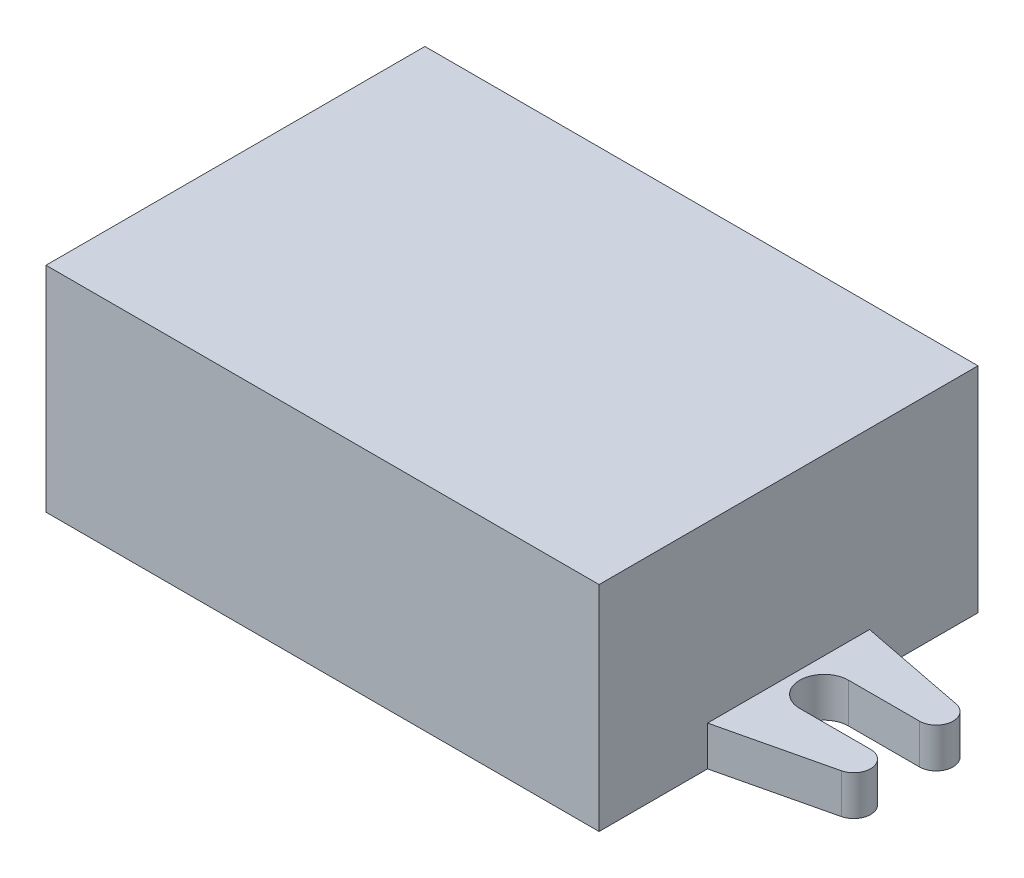
ISO-10303-21;
HEADER;
FILE_DESCRIPTION(('STEP AP214'),'2;1');
FILE_NAME('part.step','',(''),(''),'','','');
FILE_SCHEMA(('AUTOMOTIVE_DESIGN { 1 0 10303 214 1 1 1 1 }'));
ENDSEC;
DATA;
#1=APPLICATION_CONTEXT('core data for automotive mechanical design processes');
#2=APPLICATION_PROTOCOL_DEFINITION('international standard','automotive_design',2000,#1);
#3=PRODUCT_CONTEXT('',#1,'mechanical');
#4=PRODUCT('Part','Part','',(#3));
#5=PRODUCT_RELATED_PRODUCT_CATEGORY('part','',(#4));
#6=PRODUCT_DEFINITION_FORMATION('','',#4);
#7=PRODUCT_DEFINITION_CONTEXT('part definition',#1,'design');
#8=PRODUCT_DEFINITION('design','',#6,#7);
#9=PRODUCT_DEFINITION_SHAPE('','',#8);
#10=(LENGTH_UNIT() NAMED_UNIT(*) SI_UNIT(.MILLI.,.METRE.));
#11=(NAMED_UNIT(*) PLANE_ANGLE_UNIT() SI_UNIT($,.RADIAN.));
#12=(NAMED_UNIT(*) SI_UNIT($,.STERADIAN.) SOLID_ANGLE_UNIT());
#13=UNCERTAINTY_MEASURE_WITH_UNIT(LENGTH_MEASURE(1.E-05),#10,'distance_accuracy_value','');
#14=(GEOMETRIC_REPRESENTATION_CONTEXT(3) GLOBAL_UNCERTAINTY_ASSIGNED_CONTEXT((#13)) GLOBAL_UNIT_ASSIGNED_CONTEXT((#10,
#11,#12)) REPRESENTATION_CONTEXT('',''));
#15=CARTESIAN_POINT('',(0.,0.,0.));
#16=DIRECTION('',(0.,0.,1.));
#17=DIRECTION('',(1.,0.,0.));
#18=AXIS2_PLACEMENT_3D('',#15,#16,#17);
#19=CARTESIAN_POINT('',(-21.771462604241,17.78,-15.5655264340985));
#20=DIRECTION('',(1.,0.,0.));
#21=DIRECTION('',(0.,0.,-1.));
#22=AXIS2_PLACEMENT_3D('',#19,#20,#21);
#23=PLANE('',#22);
#24=DIRECTION('',(0.,-1.,0.));
#25=VECTOR('',#24,1.);
#26=CARTESIAN_POINT('',(-21.771462604241,3.302,-6.54852643409852));
#27=LINE('',#26,#25);
#28=CARTESIAN_POINT('',(-21.771462604241,3.302,-6.54852643409852));
#29=VERTEX_POINT('',#28);
#30=CARTESIAN_POINT('',(-21.771462604241,0.,-6.54852643409852));
#31=VERTEX_POINT('',#30);
#32=EDGE_CURVE('E263',#29,#31,#27,.T.);
#33=ORIENTED_EDGE('',*,*,#32,.F.);
#34=DIRECTION('',(0.,0.,-1.));
#35=VECTOR('',#34,1.);
#36=CARTESIAN_POINT('',(-21.771462604241,3.302,6.91347356590148));
#37=LINE('',#36,#35);
#38=CARTESIAN_POINT('',(-21.771462604241,3.302,6.91347356590148));
#39=VERTEX_POINT('',#38);
#40=EDGE_CURVE('E291',#39,#29,#37,.T.);
#41=ORIENTED_EDGE('',*,*,#40,.F.);
#42=DIRECTION('',(0.,-1.,0.));
#43=VECTOR('',#42,1.);
#44=CARTESIAN_POINT('',(-21.771462604241,3.302,6.91347356590148));
#45=LINE('',#44,#43);
#46=CARTESIAN_POINT('',(-21.771462604241,0.,6.91347356590149));
#47=VERTEX_POINT('',#46);
#48=EDGE_CURVE('E260',#39,#47,#45,.T.);
#49=ORIENTED_EDGE('',*,*,#48,.T.);
#50=DIRECTION('',(0.,0.,1.));
#51=VECTOR('',#50,1.);
#52=CARTESIAN_POINT('',(-21.771462604241,0.,-15.5655264340985));
#53=LINE('',#52,#51);
#54=CARTESIAN_POINT('',(-21.771462604241,0.,15.9304735659015));
#55=VERTEX_POINT('',#54);
#56=EDGE_CURVE('E256',#47,#55,#53,.T.);
#57=ORIENTED_EDGE('',*,*,#56,.T.);
#58=DIRECTION('',(0.,-1.,0.));
#59=VECTOR('',#58,1.);
#60=CARTESIAN_POINT('',(-21.771462604241,17.78,15.9304735659015));
#61=LINE('',#60,#59);
#62=CARTESIAN_POINT('',(-21.771462604241,17.78,15.9304735659015));
#63=VERTEX_POINT('',#62);
#64=EDGE_CURVE('E11',#63,#55,#61,.T.);
#65=ORIENTED_EDGE('',*,*,#64,.F.);
#66=DIRECTION('',(0.,0.,1.));
#67=VECTOR('',#66,1.);
#68=CARTESIAN_POINT('',(-21.771462604241,17.78,-15.5655264340985));
#69=LINE('',#68,#67);
#70=CARTESIAN_POINT('',(-21.771462604241,17.78,-15.5655264340985));
#71=VERTEX_POINT('',#70);
#72=EDGE_CURVE('E227',#71,#63,#69,.T.);
#73=ORIENTED_EDGE('',*,*,#72,.F.);
#74=DIRECTION('',(0.,-1.,0.));
#75=VECTOR('',#74,1.);
#76=CARTESIAN_POINT('',(-21.771462604241,17.78,-15.5655264340985));
#77=LINE('',#76,#75);
#78=CARTESIAN_POINT('',(-21.771462604241,0.,-15.5655264340985));
#79=VERTEX_POINT('',#78);
#80=EDGE_CURVE('E228',#71,#79,#77,.T.);
#81=ORIENTED_EDGE('',*,*,#80,.T.);
#82=EDGE_CURVE('E220',#79,#31,#53,.T.);
#83=ORIENTED_EDGE('',*,*,#82,.T.);
#84=EDGE_LOOP('',(#33,#41,#49,#57,#65,#73,#81,#83));
#85=FACE_BOUND('',#84,.T.);
#86=ADVANCED_FACE('F45',(#85),#23,.F.);
#87=CARTESIAN_POINT('',(-21.771462604241,17.78,15.9304735659015));
#88=DIRECTION('',(0.,0.,-1.));
#89=DIRECTION('',(-1.,0.,0.));
#90=AXIS2_PLACEMENT_3D('',#87,#88,#89);
#91=PLANE('',#90);
#92=DIRECTION('',(1.,0.,0.));
#93=VECTOR('',#92,1.);
#94=CARTESIAN_POINT('',(-21.771462604241,0.,15.9304735659015));
#95=LINE('',#94,#93);
#96=CARTESIAN_POINT('',(24.202537395759,0.,15.9304735659015));
#97=VERTEX_POINT('',#96);
#98=EDGE_CURVE('E214',#55,#97,#95,.T.);
#99=ORIENTED_EDGE('',*,*,#98,.T.);
#100=DIRECTION('',(0.,-1.,0.));
#101=VECTOR('',#100,1.);
#102=CARTESIAN_POINT('',(24.202537395759,17.78,15.9304735659015));
#103=LINE('',#102,#101);
#104=CARTESIAN_POINT('',(24.202537395759,17.78,15.9304735659015));
#105=VERTEX_POINT('',#104);
#106=EDGE_CURVE('E53',#105,#97,#103,.T.);
#107=ORIENTED_EDGE('',*,*,#106,.F.);
#108=DIRECTION('',(1.,0.,0.));
#109=VECTOR('',#108,1.);
#110=CARTESIAN_POINT('',(-21.771462604241,17.78,15.9304735659015));
#111=LINE('',#110,#109);
#112=EDGE_CURVE('E241',#63,#105,#111,.T.);
#113=ORIENTED_EDGE('',*,*,#112,.F.);
#114=ORIENTED_EDGE('',*,*,#64,.T.);
#115=EDGE_LOOP('',(#99,#107,#113,#114));
#116=FACE_BOUND('',#115,.T.);
#117=ADVANCED_FACE('F369',(#116),#91,.F.);
#118=CARTESIAN_POINT('',(24.202537395759,17.78,-15.5655264340985));
#119=DIRECTION('',(1.,0.,0.));
#120=DIRECTION('',(0.,0.,-1.));
#121=AXIS2_PLACEMENT_3D('',#118,#119,#120);
#122=PLANE('',#121);
#123=DIRECTION('',(0.,-1.,0.));
#124=VECTOR('',#123,1.);
#125=CARTESIAN_POINT('',(24.202537395759,3.302,6.91347356590148));
#126=LINE('',#125,#124);
#127=CARTESIAN_POINT('',(24.202537395759,3.302,6.91347356590148));
#128=VERTEX_POINT('',#127);
#129=CARTESIAN_POINT('',(24.202537395759,0.,6.91347356590148));
#130=VERTEX_POINT('',#129);
#131=EDGE_CURVE('E182',#128,#130,#126,.T.);
#132=ORIENTED_EDGE('',*,*,#131,.F.);
#133=DIRECTION('',(0.,0.,-1.));
#134=VECTOR('',#133,1.);
#135=CARTESIAN_POINT('',(24.202537395759,3.302,6.91347356590148));
#136=LINE('',#135,#134);
#137=CARTESIAN_POINT('',(24.202537395759,3.302,-6.54852643409852));
#138=VERTEX_POINT('',#137);
#139=EDGE_CURVE('E194',#128,#138,#136,.T.);
#140=ORIENTED_EDGE('',*,*,#139,.T.);
#141=DIRECTION('',(0.,-1.,0.));
#142=VECTOR('',#141,1.);
#143=CARTESIAN_POINT('',(24.202537395759,3.302,-6.54852643409852));
#144=LINE('',#143,#142);
#145=CARTESIAN_POINT('',(24.202537395759,0.,-6.54852643409852));
#146=VERTEX_POINT('',#145);
#147=EDGE_CURVE('E195',#138,#146,#144,.T.);
#148=ORIENTED_EDGE('',*,*,#147,.T.);
#149=DIRECTION('',(0.,0.,1.));
#150=VECTOR('',#149,1.);
#151=CARTESIAN_POINT('',(24.202537395759,0.,-15.5655264340985));
#152=LINE('',#151,#150);
#153=CARTESIAN_POINT('',(24.202537395759,0.,-15.5655264340985));
#154=VERTEX_POINT('',#153);
#155=EDGE_CURVE('E213',#154,#146,#152,.T.);
#156=ORIENTED_EDGE('',*,*,#155,.F.);
#157=DIRECTION('',(0.,-1.,0.));
#158=VECTOR('',#157,1.);
#159=CARTESIAN_POINT('',(24.202537395759,17.78,-15.5655264340985));
#160=LINE('',#159,#158);
#161=CARTESIAN_POINT('',(24.202537395759,17.78,-15.5655264340985));
#162=VERTEX_POINT('',#161);
#163=EDGE_CURVE('E231',#162,#154,#160,.T.);
#164=ORIENTED_EDGE('',*,*,#163,.F.);
#165=DIRECTION('',(0.,0.,1.));
#166=VECTOR('',#165,1.);
#167=CARTESIAN_POINT('',(24.202537395759,17.78,-15.5655264340985));
#168=LINE('',#167,#166);
#169=EDGE_CURVE('E238',#162,#105,#168,.T.);
#170=ORIENTED_EDGE('',*,*,#169,.T.);
#171=ORIENTED_EDGE('',*,*,#106,.T.);
#172=EDGE_CURVE('E201',#130,#97,#152,.T.);
#173=ORIENTED_EDGE('',*,*,#172,.F.);
#174=EDGE_LOOP('',(#132,#140,#148,#156,#164,#170,#171,#173));
#175=FACE_BOUND('',#174,.T.);
#176=ADVANCED_FACE('F208',(#175),#122,.T.);
#177=CARTESIAN_POINT('',(-21.771462604241,17.78,-15.5655264340985));
#178=DIRECTION('',(0.,0.,-1.));
#179=DIRECTION('',(-1.,0.,0.));
#180=AXIS2_PLACEMENT_3D('',#177,#178,#179);
#181=PLANE('',#180);
#182=DIRECTION('',(1.,0.,0.));
#183=VECTOR('',#182,1.);
#184=CARTESIAN_POINT('',(-21.771462604241,0.,-15.5655264340985));
#185=LINE('',#184,#183);
#186=EDGE_CURVE('E219',#79,#154,#185,.T.);
#187=ORIENTED_EDGE('',*,*,#186,.F.);
#188=ORIENTED_EDGE('',*,*,#80,.F.);
#189=DIRECTION('',(1.,0.,0.));
#190=VECTOR('',#189,1.);
#191=CARTESIAN_POINT('',(-21.771462604241,17.78,-15.5655264340985));
#192=LINE('',#191,#190);
#193=EDGE_CURVE('E232',#71,#162,#192,.T.);
#194=ORIENTED_EDGE('',*,*,#193,.T.);
#195=ORIENTED_EDGE('',*,*,#163,.T.);
#196=EDGE_LOOP('',(#187,#188,#194,#195));
#197=FACE_BOUND('',#196,.T.);
#198=ADVANCED_FACE('F378',(#197),#181,.T.);
#199=CARTESIAN_POINT('',(0.,17.78,0.));
#200=DIRECTION('',(0.,1.,0.));
#201=DIRECTION('',(0.,0.,1.));
#202=AXIS2_PLACEMENT_3D('',#199,#200,#201);
#203=PLANE('',#202);
#204=ORIENTED_EDGE('',*,*,#72,.T.);
#205=ORIENTED_EDGE('',*,*,#112,.T.);
#206=ORIENTED_EDGE('',*,*,#169,.F.);
#207=ORIENTED_EDGE('',*,*,#193,.F.);
#208=EDGE_LOOP('',(#204,#205,#206,#207));
#209=FACE_BOUND('',#208,.T.);
#210=ADVANCED_FACE('F495',(#209),#203,.T.);
#211=CARTESIAN_POINT('',(0.,0.,0.));
#212=DIRECTION('',(0.,1.,0.));
#213=DIRECTION('',(0.,0.,1.));
#214=AXIS2_PLACEMENT_3D('',#211,#212,#213);
#215=PLANE('',#214);
#216=ORIENTED_EDGE('',*,*,#82,.F.);
#217=ORIENTED_EDGE('',*,*,#186,.T.);
#218=ORIENTED_EDGE('',*,*,#155,.T.);
#219=DIRECTION('',(0.98132204195666,0.,0.192372165268294));
#220=VECTOR('',#219,1.);
#221=CARTESIAN_POINT('',(24.202537395759,0.,-6.54852643409852));
#222=LINE('',#221,#220);
#223=CARTESIAN_POINT('',(33.2318712642548,0.,-4.77847294202625));
#224=VERTEX_POINT('',#223);
#225=EDGE_CURVE('E60',#146,#224,#222,.T.);
#226=ORIENTED_EDGE('',*,*,#225,.T.);
#227=CARTESIAN_POINT('',(32.8705794448912,0.,-3.42900000000001));
#228=DIRECTION('',(0.,1.,0.));
#229=DIRECTION('',(0.,0.,1.));
#230=AXIS2_PLACEMENT_3D('',#227,#228,#229);
#231=CIRCLE('',#230,1.397);
#232=CARTESIAN_POINT('',(32.8705794448912,0.,-2.03200000000001));
#233=VERTEX_POINT('',#232);
#234=EDGE_CURVE('E384',#233,#224,#231,.T.);
#235=ORIENTED_EDGE('',*,*,#234,.F.);
#236=DIRECTION('',(-1.,0.,0.));
#237=VECTOR('',#236,1.);
#238=CARTESIAN_POINT('',(32.8705794448912,0.,-2.03200000000001));
#239=LINE('',#238,#237);
#240=CARTESIAN_POINT('',(26.9776546509918,0.,-2.03200000000001));
#241=VERTEX_POINT('',#240);
#242=EDGE_CURVE('E390',#233,#241,#239,.T.);
#243=ORIENTED_EDGE('',*,*,#242,.T.);
#244=CARTESIAN_POINT('',(26.9776546509918,0.,0.));
#245=DIRECTION('',(0.,1.,0.));
#246=DIRECTION('',(0.,0.,1.));
#247=AXIS2_PLACEMENT_3D('',#244,#245,#246);
#248=CIRCLE('',#247,2.032);
#249=CARTESIAN_POINT('',(26.9776546509918,0.,2.03199999999999));
#250=VERTEX_POINT('',#249);
#251=EDGE_CURVE('E397',#241,#250,#248,.T.);
#252=ORIENTED_EDGE('',*,*,#251,.T.);
#253=DIRECTION('',(-1.,0.,0.));
#254=VECTOR('',#253,1.);
#255=CARTESIAN_POINT('',(32.8705794448912,0.,2.03199999999999));
#256=LINE('',#255,#254);
#257=CARTESIAN_POINT('',(32.8705794448912,0.,2.03199999999999));
#258=VERTEX_POINT('',#257);
#259=EDGE_CURVE('E401',#258,#250,#256,.T.);
#260=ORIENTED_EDGE('',*,*,#259,.F.);
#261=CARTESIAN_POINT('',(32.8705794448912,0.,3.42899999999999));
#262=DIRECTION('',(0.,1.,0.));
#263=DIRECTION('',(0.,0.,1.));
#264=AXIS2_PLACEMENT_3D('',#261,#262,#263);
#265=CIRCLE('',#264,1.397);
#266=CARTESIAN_POINT('',(33.191916601946,0.,4.78854088996836));
#267=VERTEX_POINT('',#266);
#268=EDGE_CURVE('E204',#267,#258,#265,.T.);
#269=ORIENTED_EDGE('',*,*,#268,.F.);
#270=DIRECTION('',(0.973180485038376,0.,-0.230042916736143));
#271=VECTOR('',#270,1.);
#272=CARTESIAN_POINT('',(24.202537395759,0.,6.91347356590148));
#273=LINE('',#272,#271);
#274=EDGE_CURVE('E186',#130,#267,#273,.T.);
#275=ORIENTED_EDGE('',*,*,#274,.F.);
#276=ORIENTED_EDGE('',*,*,#172,.T.);
#277=ORIENTED_EDGE('',*,*,#98,.F.);
#278=ORIENTED_EDGE('',*,*,#56,.F.);
#279=DIRECTION('',(-0.973180485038376,0.,-0.230042916736143));
#280=VECTOR('',#279,1.);
#281=CARTESIAN_POINT('',(-21.771462604241,0.,6.91347356590148));
#282=LINE('',#281,#280);
#283=CARTESIAN_POINT('',(-30.760841810428,0.,4.78854088996837));
#284=VERTEX_POINT('',#283);
#285=EDGE_CURVE('E68',#47,#284,#282,.T.);
#286=ORIENTED_EDGE('',*,*,#285,.T.);
#287=CARTESIAN_POINT('',(-30.4395046533733,0.,3.429));
#288=DIRECTION('',(0.,-1.,0.));
#289=DIRECTION('',(0.,0.,-1.));
#290=AXIS2_PLACEMENT_3D('',#287,#288,#289);
#291=CIRCLE('',#290,1.397);
#292=CARTESIAN_POINT('',(-30.4395046533733,0.,2.032));
#293=VERTEX_POINT('',#292);
#294=EDGE_CURVE('E306',#284,#293,#291,.T.);
#295=ORIENTED_EDGE('',*,*,#294,.T.);
#296=DIRECTION('',(1.,0.,0.));
#297=VECTOR('',#296,1.);
#298=CARTESIAN_POINT('',(-30.4395046533733,0.,2.032));
#299=LINE('',#298,#297);
#300=CARTESIAN_POINT('',(-24.5465798594738,0.,2.032));
#301=VERTEX_POINT('',#300);
#302=EDGE_CURVE('E310',#293,#301,#299,.T.);
#303=ORIENTED_EDGE('',*,*,#302,.T.);
#304=CARTESIAN_POINT('',(-24.5465798594738,0.,0.));
#305=DIRECTION('',(0.,-1.,0.));
#306=DIRECTION('',(0.,0.,-1.));
#307=AXIS2_PLACEMENT_3D('',#304,#305,#306);
#308=CIRCLE('',#307,2.032);
#309=CARTESIAN_POINT('',(-24.5465798594738,0.,-2.032));
#310=VERTEX_POINT('',#309);
#311=EDGE_CURVE('E314',#310,#301,#308,.T.);
#312=ORIENTED_EDGE('',*,*,#311,.F.);
#313=DIRECTION('',(1.,0.,0.));
#314=VECTOR('',#313,1.);
#315=CARTESIAN_POINT('',(-30.4395046533733,0.,-2.032));
#316=LINE('',#315,#314);
#317=CARTESIAN_POINT('',(-30.4395046533733,0.,-2.032));
#318=VERTEX_POINT('',#317);
#319=EDGE_CURVE('E318',#318,#310,#316,.T.);
#320=ORIENTED_EDGE('',*,*,#319,.F.);
#321=CARTESIAN_POINT('',(-30.4395046533733,0.,-3.429));
#322=DIRECTION('',(0.,-1.,0.));
#323=DIRECTION('',(0.,0.,-1.));
#324=AXIS2_PLACEMENT_3D('',#321,#322,#323);
#325=CIRCLE('',#324,1.397);
#326=CARTESIAN_POINT('',(-30.8007964727368,0.,-4.77847294202625));
#327=VERTEX_POINT('',#326);
#328=EDGE_CURVE('E320',#318,#327,#325,.T.);
#329=ORIENTED_EDGE('',*,*,#328,.T.);
#330=DIRECTION('',(-0.98132204195666,0.,0.192372165268294));
#331=VECTOR('',#330,1.);
#332=CARTESIAN_POINT('',(-21.771462604241,0.,-6.54852643409852));
#333=LINE('',#332,#331);
#334=EDGE_CURVE('E270',#31,#327,#333,.T.);
#335=ORIENTED_EDGE('',*,*,#334,.F.);
#336=EDGE_LOOP('',(#216,#217,#218,#226,#235,#243,#252,#260,#269,#275,#276,#277,#278,#286,#295,
#303,#312,#320,#329,#335));
#337=FACE_BOUND('',#336,.T.);
#338=ADVANCED_FACE('F199',(#337),#215,.F.);
#339=CARTESIAN_POINT('',(-21.771462604241,3.302,6.91347356590148));
#340=DIRECTION('',(-0.230042916736143,0.,0.973180485038376));
#341=DIRECTION('',(0.973180485038376,0.,0.230042916736143));
#342=AXIS2_PLACEMENT_3D('',#339,#340,#341);
#343=PLANE('',#342);
#344=ORIENTED_EDGE('',*,*,#285,.F.);
#345=ORIENTED_EDGE('',*,*,#48,.F.);
#346=DIRECTION('',(-0.973180485038376,0.,-0.230042916736143));
#347=VECTOR('',#346,1.);
#348=CARTESIAN_POINT('',(-21.771462604241,3.302,6.91347356590148));
#349=LINE('',#348,#347);
#350=CARTESIAN_POINT('',(-30.760841810428,3.302,4.78854088996837));
#351=VERTEX_POINT('',#350);
#352=EDGE_CURVE('E328',#39,#351,#349,.T.);
#353=ORIENTED_EDGE('',*,*,#352,.T.);
#354=DIRECTION('',(0.,-1.,0.));
#355=VECTOR('',#354,1.);
#356=CARTESIAN_POINT('',(-30.760841810428,3.302,4.78854088996837));
#357=LINE('',#356,#355);
#358=EDGE_CURVE('E252',#351,#284,#357,.T.);
#359=ORIENTED_EDGE('',*,*,#358,.T.);
#360=EDGE_LOOP('',(#344,#345,#353,#359));
#361=FACE_BOUND('',#360,.T.);
#362=ADVANCED_FACE('F358',(#361),#343,.T.);
#363=CARTESIAN_POINT('',(-21.771462604241,3.302,-6.54852643409852));
#364=DIRECTION('',(0.192372165268294,0.,0.98132204195666));
#365=DIRECTION('',(0.98132204195666,0.,-0.192372165268294));
#366=AXIS2_PLACEMENT_3D('',#363,#364,#365);
#367=PLANE('',#366);
#368=ORIENTED_EDGE('',*,*,#334,.T.);
#369=DIRECTION('',(0.,-1.,0.));
#370=VECTOR('',#369,1.);
#371=CARTESIAN_POINT('',(-30.8007964727368,3.302,-4.77847294202625));
#372=LINE('',#371,#370);
#373=CARTESIAN_POINT('',(-30.8007964727368,3.302,-4.77847294202625));
#374=VERTEX_POINT('',#373);
#375=EDGE_CURVE('E267',#374,#327,#372,.T.);
#376=ORIENTED_EDGE('',*,*,#375,.F.);
#377=DIRECTION('',(-0.98132204195666,0.,0.192372165268294));
#378=VECTOR('',#377,1.);
#379=CARTESIAN_POINT('',(-21.771462604241,3.302,-6.54852643409852));
#380=LINE('',#379,#378);
#381=EDGE_CURVE('E294',#29,#374,#380,.T.);
#382=ORIENTED_EDGE('',*,*,#381,.F.);
#383=ORIENTED_EDGE('',*,*,#32,.T.);
#384=EDGE_LOOP('',(#368,#376,#382,#383));
#385=FACE_BOUND('',#384,.T.);
#386=ADVANCED_FACE('F356',(#385),#367,.F.);
#387=CARTESIAN_POINT('',(-30.4395046533733,3.302,-3.429));
#388=DIRECTION('',(0.,-1.,0.));
#389=DIRECTION('',(0.,0.,-1.));
#390=AXIS2_PLACEMENT_3D('',#387,#388,#389);
#391=CYLINDRICAL_SURFACE('',#390,1.397);
#392=ORIENTED_EDGE('',*,*,#328,.F.);
#393=DIRECTION('',(0.,-1.,0.));
#394=VECTOR('',#393,1.);
#395=CARTESIAN_POINT('',(-30.4395046533733,3.302,-2.032));
#396=LINE('',#395,#394);
#397=CARTESIAN_POINT('',(-30.4395046533733,3.302,-2.032));
#398=VERTEX_POINT('',#397);
#399=EDGE_CURVE('E275',#398,#318,#396,.T.);
#400=ORIENTED_EDGE('',*,*,#399,.F.);
#401=CARTESIAN_POINT('',(-30.4395046533733,3.302,-3.429));
#402=DIRECTION('',(0.,-1.,0.));
#403=DIRECTION('',(0.,0.,-1.));
#404=AXIS2_PLACEMENT_3D('',#401,#402,#403);
#405=CIRCLE('',#404,1.397);
#406=EDGE_CURVE('E300',#398,#374,#405,.T.);
#407=ORIENTED_EDGE('',*,*,#406,.T.);
#408=ORIENTED_EDGE('',*,*,#375,.T.);
#409=EDGE_LOOP('',(#392,#400,#407,#408));
#410=FACE_BOUND('',#409,.T.);
#411=ADVANCED_FACE('F352',(#410),#391,.T.);
#412=CARTESIAN_POINT('',(-30.4395046533733,3.302,-2.032));
#413=DIRECTION('',(0.,0.,-1.));
#414=DIRECTION('',(-1.,0.,0.));
#415=AXIS2_PLACEMENT_3D('',#412,#413,#414);
#416=PLANE('',#415);
#417=ORIENTED_EDGE('',*,*,#319,.T.);
#418=DIRECTION('',(0.,-1.,0.));
#419=VECTOR('',#418,1.);
#420=CARTESIAN_POINT('',(-24.5465798594738,3.302,-2.032));
#421=LINE('',#420,#419);
#422=CARTESIAN_POINT('',(-24.5465798594738,3.302,-2.032));
#423=VERTEX_POINT('',#422);
#424=EDGE_CURVE('E278',#423,#310,#421,.T.);
#425=ORIENTED_EDGE('',*,*,#424,.F.);
#426=DIRECTION('',(1.,0.,0.));
#427=VECTOR('',#426,1.);
#428=CARTESIAN_POINT('',(-30.4395046533733,3.302,-2.032));
#429=LINE('',#428,#427);
#430=EDGE_CURVE('E346',#398,#423,#429,.T.);
#431=ORIENTED_EDGE('',*,*,#430,.F.);
#432=ORIENTED_EDGE('',*,*,#399,.T.);
#433=EDGE_LOOP('',(#417,#425,#431,#432));
#434=FACE_BOUND('',#433,.T.);
#435=ADVANCED_FACE('F364',(#434),#416,.F.);
#436=CARTESIAN_POINT('',(-24.5465798594738,3.302,0.));
#437=DIRECTION('',(0.,-1.,0.));
#438=DIRECTION('',(0.,0.,-1.));
#439=AXIS2_PLACEMENT_3D('',#436,#437,#438);
#440=CYLINDRICAL_SURFACE('',#439,2.032);
#441=ORIENTED_EDGE('',*,*,#311,.T.);
#442=DIRECTION('',(0.,-1.,0.));
#443=VECTOR('',#442,1.);
#444=CARTESIAN_POINT('',(-24.5465798594738,3.302,2.032));
#445=LINE('',#444,#443);
#446=CARTESIAN_POINT('',(-24.5465798594738,3.302,2.032));
#447=VERTEX_POINT('',#446);
#448=EDGE_CURVE('E282',#447,#301,#445,.T.);
#449=ORIENTED_EDGE('',*,*,#448,.F.);
#450=CARTESIAN_POINT('',(-24.5465798594738,3.302,0.));
#451=DIRECTION('',(0.,-1.,0.));
#452=DIRECTION('',(0.,0.,-1.));
#453=AXIS2_PLACEMENT_3D('',#450,#451,#452);
#454=CIRCLE('',#453,2.032);
#455=EDGE_CURVE('E343',#423,#447,#454,.T.);
#456=ORIENTED_EDGE('',*,*,#455,.F.);
#457=ORIENTED_EDGE('',*,*,#424,.T.);
#458=EDGE_LOOP('',(#441,#449,#456,#457));
#459=FACE_BOUND('',#458,.T.);
#460=ADVANCED_FACE('F490',(#459),#440,.F.);
#461=CARTESIAN_POINT('',(-30.4395046533733,3.302,2.032));
#462=DIRECTION('',(0.,0.,-1.));
#463=DIRECTION('',(-1.,0.,0.));
#464=AXIS2_PLACEMENT_3D('',#461,#462,#463);
#465=PLANE('',#464);
#466=ORIENTED_EDGE('',*,*,#302,.F.);
#467=DIRECTION('',(0.,-1.,0.));
#468=VECTOR('',#467,1.);
#469=CARTESIAN_POINT('',(-30.4395046533733,3.302,2.032));
#470=LINE('',#469,#468);
#471=CARTESIAN_POINT('',(-30.4395046533733,3.302,2.032));
#472=VERTEX_POINT('',#471);
#473=EDGE_CURVE('E284',#472,#293,#470,.T.);
#474=ORIENTED_EDGE('',*,*,#473,.F.);
#475=DIRECTION('',(1.,0.,0.));
#476=VECTOR('',#475,1.);
#477=CARTESIAN_POINT('',(-30.4395046533733,3.302,2.032));
#478=LINE('',#477,#476);
#479=EDGE_CURVE('E335',#472,#447,#478,.T.);
#480=ORIENTED_EDGE('',*,*,#479,.T.);
#481=ORIENTED_EDGE('',*,*,#448,.T.);
#482=EDGE_LOOP('',(#466,#474,#480,#481));
#483=FACE_BOUND('',#482,.T.);
#484=ADVANCED_FACE('F485',(#483),#465,.T.);
#485=CARTESIAN_POINT('',(-30.4395046533733,3.302,3.429));
#486=DIRECTION('',(0.,-1.,0.));
#487=DIRECTION('',(0.,0.,-1.));
#488=AXIS2_PLACEMENT_3D('',#485,#486,#487);
#489=CYLINDRICAL_SURFACE('',#488,1.397);
#490=ORIENTED_EDGE('',*,*,#294,.F.);
#491=ORIENTED_EDGE('',*,*,#358,.F.);
#492=CARTESIAN_POINT('',(-30.4395046533733,3.302,3.429));
#493=DIRECTION('',(0.,-1.,0.));
#494=DIRECTION('',(0.,0.,-1.));
#495=AXIS2_PLACEMENT_3D('',#492,#493,#494);
#496=CIRCLE('',#495,1.397);
#497=EDGE_CURVE('E332',#351,#472,#496,.T.);
#498=ORIENTED_EDGE('',*,*,#497,.T.);
#499=ORIENTED_EDGE('',*,*,#473,.T.);
#500=EDGE_LOOP('',(#490,#491,#498,#499));
#501=FACE_BOUND('',#500,.T.);
#502=ADVANCED_FACE('F479',(#501),#489,.T.);
#503=CARTESIAN_POINT('',(-30.4395046533733,3.302,3.429));
#504=DIRECTION('',(0.,-1.,0.));
#505=DIRECTION('',(0.,0.,-1.));
#506=AXIS2_PLACEMENT_3D('',#503,#504,#505);
#507=PLANE('',#506);
#508=ORIENTED_EDGE('',*,*,#352,.F.);
#509=ORIENTED_EDGE('',*,*,#40,.T.);
#510=ORIENTED_EDGE('',*,*,#381,.T.);
#511=ORIENTED_EDGE('',*,*,#406,.F.);
#512=ORIENTED_EDGE('',*,*,#430,.T.);
#513=ORIENTED_EDGE('',*,*,#455,.T.);
#514=ORIENTED_EDGE('',*,*,#479,.F.);
#515=ORIENTED_EDGE('',*,*,#497,.F.);
#516=EDGE_LOOP('',(#508,#509,#510,#511,#512,#513,#514,#515));
#517=FACE_BOUND('',#516,.T.);
#518=ADVANCED_FACE('F354',(#517),#507,.F.);
#519=CARTESIAN_POINT('',(24.202537395759,3.302,6.91347356590148));
#520=DIRECTION('',(-0.230042916736143,0.,-0.973180485038376));
#521=DIRECTION('',(-0.973180485038376,0.,0.230042916736143));
#522=AXIS2_PLACEMENT_3D('',#519,#520,#521);
#523=PLANE('',#522);
#524=ORIENTED_EDGE('',*,*,#274,.T.);
#525=DIRECTION('',(0.,-1.,0.));
#526=VECTOR('',#525,1.);
#527=CARTESIAN_POINT('',(33.191916601946,3.302,4.78854088996836));
#528=LINE('',#527,#526);
#529=CARTESIAN_POINT('',(33.191916601946,3.302,4.78854088996836));
#530=VERTEX_POINT('',#529);
#531=EDGE_CURVE('E440',#530,#267,#528,.T.);
#532=ORIENTED_EDGE('',*,*,#531,.F.);
#533=DIRECTION('',(0.973180485038376,0.,-0.230042916736143));
#534=VECTOR('',#533,1.);
#535=CARTESIAN_POINT('',(24.202537395759,3.302,6.91347356590148));
#536=LINE('',#535,#534);
#537=EDGE_CURVE('E188',#128,#530,#536,.T.);
#538=ORIENTED_EDGE('',*,*,#537,.F.);
#539=ORIENTED_EDGE('',*,*,#131,.T.);
#540=EDGE_LOOP('',(#524,#532,#538,#539));
#541=FACE_BOUND('',#540,.T.);
#542=ADVANCED_FACE('F184',(#541),#523,.F.);
#543=CARTESIAN_POINT('',(32.8705794448912,3.302,3.42899999999999));
#544=DIRECTION('',(0.,-1.,0.));
#545=DIRECTION('',(0.,0.,-1.));
#546=AXIS2_PLACEMENT_3D('',#543,#544,#545);
#547=CYLINDRICAL_SURFACE('',#546,1.397);
#548=ORIENTED_EDGE('',*,*,#268,.T.);
#549=DIRECTION('',(0.,-1.,0.));
#550=VECTOR('',#549,1.);
#551=CARTESIAN_POINT('',(32.8705794448912,3.302,2.03199999999999));
#552=LINE('',#551,#550);
#553=CARTESIAN_POINT('',(32.8705794448912,3.302,2.03199999999999));
#554=VERTEX_POINT('',#553);
#555=EDGE_CURVE('E435',#554,#258,#552,.T.);
#556=ORIENTED_EDGE('',*,*,#555,.F.);
#557=CARTESIAN_POINT('',(32.8705794448912,3.302,3.42899999999999));
#558=DIRECTION('',(0.,1.,0.));
#559=DIRECTION('',(0.,0.,1.));
#560=AXIS2_PLACEMENT_3D('',#557,#558,#559);
#561=CIRCLE('',#560,1.397);
#562=EDGE_CURVE('E392',#530,#554,#561,.T.);
#563=ORIENTED_EDGE('',*,*,#562,.F.);
#564=ORIENTED_EDGE('',*,*,#531,.T.);
#565=EDGE_LOOP('',(#548,#556,#563,#564));
#566=FACE_BOUND('',#565,.T.);
#567=ADVANCED_FACE('F436',(#566),#547,.T.);
#568=CARTESIAN_POINT('',(32.8705794448912,3.302,2.03199999999999));
#569=DIRECTION('',(0.,0.,1.));
#570=DIRECTION('',(1.,0.,0.));
#571=AXIS2_PLACEMENT_3D('',#568,#569,#570);
#572=PLANE('',#571);
#573=ORIENTED_EDGE('',*,*,#259,.T.);
#574=DIRECTION('',(0.,-1.,0.));
#575=VECTOR('',#574,1.);
#576=CARTESIAN_POINT('',(26.9776546509918,3.302,2.03199999999999));
#577=LINE('',#576,#575);
#578=CARTESIAN_POINT('',(26.9776546509918,3.302,2.03199999999999));
#579=VERTEX_POINT('',#578);
#580=EDGE_CURVE('E439',#579,#250,#577,.T.);
#581=ORIENTED_EDGE('',*,*,#580,.F.);
#582=DIRECTION('',(-1.,0.,0.));
#583=VECTOR('',#582,1.);
#584=CARTESIAN_POINT('',(32.8705794448912,3.302,2.03199999999999));
#585=LINE('',#584,#583);
#586=EDGE_CURVE('E424',#554,#579,#585,.T.);
#587=ORIENTED_EDGE('',*,*,#586,.F.);
#588=ORIENTED_EDGE('',*,*,#555,.T.);
#589=EDGE_LOOP('',(#573,#581,#587,#588));
#590=FACE_BOUND('',#589,.T.);
#591=ADVANCED_FACE('F442',(#590),#572,.F.);
#592=CARTESIAN_POINT('',(26.9776546509918,3.302,0.));
#593=DIRECTION('',(0.,-1.,0.));
#594=DIRECTION('',(0.,0.,-1.));
#595=AXIS2_PLACEMENT_3D('',#592,#593,#594);
#596=CYLINDRICAL_SURFACE('',#595,2.032);
#597=ORIENTED_EDGE('',*,*,#251,.F.);
#598=DIRECTION('',(0.,-1.,0.));
#599=VECTOR('',#598,1.);
#600=CARTESIAN_POINT('',(26.9776546509918,3.302,-2.03200000000001));
#601=LINE('',#600,#599);
#602=CARTESIAN_POINT('',(26.9776546509918,3.302,-2.03200000000001));
#603=VERTEX_POINT('',#602);
#604=EDGE_CURVE('E446',#603,#241,#601,.T.);
#605=ORIENTED_EDGE('',*,*,#604,.F.);
#606=CARTESIAN_POINT('',(26.9776546509918,3.302,0.));
#607=DIRECTION('',(0.,1.,0.));
#608=DIRECTION('',(0.,0.,1.));
#609=AXIS2_PLACEMENT_3D('',#606,#607,#608);
#610=CIRCLE('',#609,2.032);
#611=EDGE_CURVE('E420',#603,#579,#610,.T.);
#612=ORIENTED_EDGE('',*,*,#611,.T.);
#613=ORIENTED_EDGE('',*,*,#580,.T.);
#614=EDGE_LOOP('',(#597,#605,#612,#613));
#615=FACE_BOUND('',#614,.T.);
#616=ADVANCED_FACE('F448',(#615),#596,.F.);
#617=CARTESIAN_POINT('',(32.8705794448912,3.302,-2.03200000000001));
#618=DIRECTION('',(0.,0.,1.));
#619=DIRECTION('',(1.,0.,0.));
#620=AXIS2_PLACEMENT_3D('',#617,#618,#619);
#621=PLANE('',#620);
#622=ORIENTED_EDGE('',*,*,#242,.F.);
#623=DIRECTION('',(0.,-1.,0.));
#624=VECTOR('',#623,1.);
#625=CARTESIAN_POINT('',(32.8705794448912,3.302,-2.03200000000001));
#626=LINE('',#625,#624);
#627=CARTESIAN_POINT('',(32.8705794448912,3.302,-2.03200000000001));
#628=VERTEX_POINT('',#627);
#629=EDGE_CURVE('E452',#628,#233,#626,.T.);
#630=ORIENTED_EDGE('',*,*,#629,.F.);
#631=DIRECTION('',(-1.,0.,0.));
#632=VECTOR('',#631,1.);
#633=CARTESIAN_POINT('',(32.8705794448912,3.302,-2.03200000000001));
#634=LINE('',#633,#632);
#635=EDGE_CURVE('E416',#628,#603,#634,.T.);
#636=ORIENTED_EDGE('',*,*,#635,.T.);
#637=ORIENTED_EDGE('',*,*,#604,.T.);
#638=EDGE_LOOP('',(#622,#630,#636,#637));
#639=FACE_BOUND('',#638,.T.);
#640=ADVANCED_FACE('F451',(#639),#621,.T.);
#641=CARTESIAN_POINT('',(32.8705794448912,3.302,-3.42900000000001));
#642=DIRECTION('',(0.,-1.,0.));
#643=DIRECTION('',(0.,0.,-1.));
#644=AXIS2_PLACEMENT_3D('',#641,#642,#643);
#645=CYLINDRICAL_SURFACE('',#644,1.397);
#646=ORIENTED_EDGE('',*,*,#234,.T.);
#647=DIRECTION('',(0.,-1.,0.));
#648=VECTOR('',#647,1.);
#649=CARTESIAN_POINT('',(33.2318712642548,3.302,-4.77847294202625));
#650=LINE('',#649,#648);
#651=CARTESIAN_POINT('',(33.2318712642548,3.302,-4.77847294202625));
#652=VERTEX_POINT('',#651);
#653=EDGE_CURVE('E456',#652,#224,#650,.T.);
#654=ORIENTED_EDGE('',*,*,#653,.F.);
#655=CARTESIAN_POINT('',(32.8705794448912,3.302,-3.42900000000001));
#656=DIRECTION('',(0.,1.,0.));
#657=DIRECTION('',(0.,0.,1.));
#658=AXIS2_PLACEMENT_3D('',#655,#656,#657);
#659=CIRCLE('',#658,1.397);
#660=EDGE_CURVE('E413',#628,#652,#659,.T.);
#661=ORIENTED_EDGE('',*,*,#660,.F.);
#662=ORIENTED_EDGE('',*,*,#629,.T.);
#663=EDGE_LOOP('',(#646,#654,#661,#662));
#664=FACE_BOUND('',#663,.T.);
#665=ADVANCED_FACE('F459',(#664),#645,.T.);
#666=CARTESIAN_POINT('',(24.202537395759,3.302,-6.54852643409852));
#667=DIRECTION('',(0.192372165268294,0.,-0.98132204195666));
#668=DIRECTION('',(-0.98132204195666,0.,-0.192372165268294));
#669=AXIS2_PLACEMENT_3D('',#666,#667,#668);
#670=PLANE('',#669);
#671=ORIENTED_EDGE('',*,*,#225,.F.);
#672=ORIENTED_EDGE('',*,*,#147,.F.);
#673=DIRECTION('',(0.98132204195666,0.,0.192372165268294));
#674=VECTOR('',#673,1.);
#675=CARTESIAN_POINT('',(24.202537395759,3.302,-6.54852643409852));
#676=LINE('',#675,#674);
#677=EDGE_CURVE('E409',#138,#652,#676,.T.);
#678=ORIENTED_EDGE('',*,*,#677,.T.);
#679=ORIENTED_EDGE('',*,*,#653,.T.);
#680=EDGE_LOOP('',(#671,#672,#678,#679));
#681=FACE_BOUND('',#680,.T.);
#682=ADVANCED_FACE('F461',(#681),#670,.T.);
#683=CARTESIAN_POINT('',(32.8705794448912,3.302,3.42899999999999));
#684=DIRECTION('',(0.,1.,0.));
#685=DIRECTION('',(0.,0.,1.));
#686=AXIS2_PLACEMENT_3D('',#683,#684,#685);
#687=PLANE('',#686);
#688=ORIENTED_EDGE('',*,*,#537,.T.);
#689=ORIENTED_EDGE('',*,*,#562,.T.);
#690=ORIENTED_EDGE('',*,*,#586,.T.);
#691=ORIENTED_EDGE('',*,*,#611,.F.);
#692=ORIENTED_EDGE('',*,*,#635,.F.);
#693=ORIENTED_EDGE('',*,*,#660,.T.);
#694=ORIENTED_EDGE('',*,*,#677,.F.);
#695=ORIENTED_EDGE('',*,*,#139,.F.);
#696=EDGE_LOOP('',(#688,#689,#690,#691,#692,#693,#694,#695));
#697=FACE_BOUND('',#696,.T.);
#698=ADVANCED_FACE('F429',(#697),#687,.T.);
#699=CLOSED_SHELL('',(#86,#117,#176,#198,#210,#338,#362,#386,#411,#435,#460,#484,#502,#518,#542,
#567,#591,#616,#640,#665,#682,#698));
#700=MANIFOLD_SOLID_BREP('B2',#699);
#701=ADVANCED_BREP_SHAPE_REPRESENTATION('',(#18,#700),#14);
#702=SHAPE_DEFINITION_REPRESENTATION(#9,#701);
ENDSEC;
END-ISO-10303-21;
